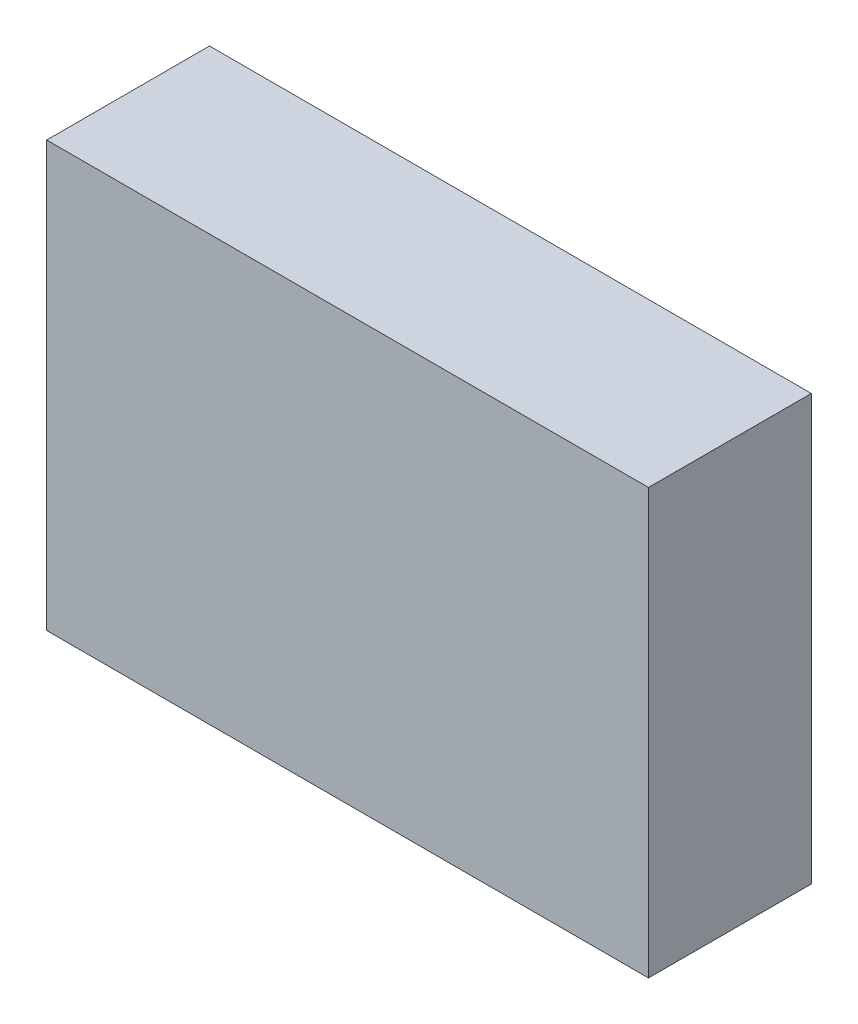
ISO-10303-21;
HEADER;
FILE_DESCRIPTION(('STEP AP214'),'2;1');
FILE_NAME('part.step','',(''),(''),'','','');
FILE_SCHEMA(('AUTOMOTIVE_DESIGN { 1 0 10303 214 1 1 1 1 }'));
ENDSEC;
DATA;
#1=APPLICATION_CONTEXT('core data for automotive mechanical design processes');
#2=APPLICATION_PROTOCOL_DEFINITION('international standard','automotive_design',2000,#1);
#3=PRODUCT_CONTEXT('',#1,'mechanical');
#4=PRODUCT('Part','Part','',(#3));
#5=PRODUCT_RELATED_PRODUCT_CATEGORY('part','',(#4));
#6=PRODUCT_DEFINITION_FORMATION('','',#4);
#7=PRODUCT_DEFINITION_CONTEXT('part definition',#1,'design');
#8=PRODUCT_DEFINITION('design','',#6,#7);
#9=PRODUCT_DEFINITION_SHAPE('','',#8);
#10=(LENGTH_UNIT() NAMED_UNIT(*) SI_UNIT(.MILLI.,.METRE.));
#11=(NAMED_UNIT(*) PLANE_ANGLE_UNIT() SI_UNIT($,.RADIAN.));
#12=(NAMED_UNIT(*) SI_UNIT($,.STERADIAN.) SOLID_ANGLE_UNIT());
#13=UNCERTAINTY_MEASURE_WITH_UNIT(LENGTH_MEASURE(1.E-05),#10,'distance_accuracy_value','');
#14=(GEOMETRIC_REPRESENTATION_CONTEXT(3) GLOBAL_UNCERTAINTY_ASSIGNED_CONTEXT((#13)) GLOBAL_UNIT_ASSIGNED_CONTEXT((#10,
#11,#12)) REPRESENTATION_CONTEXT('',''));
#15=CARTESIAN_POINT('',(0.,0.,0.));
#16=DIRECTION('',(0.,0.,1.));
#17=DIRECTION('',(1.,0.,0.));
#18=AXIS2_PLACEMENT_3D('',#15,#16,#17);
#19=CARTESIAN_POINT('',(15.999587155177,15.3126483669053,2.3));
#20=DIRECTION('',(1.,0.,0.));
#21=DIRECTION('',(0.,1.,0.));
#22=AXIS2_PLACEMENT_3D('',#19,#20,#21);
#23=PLANE('',#22);
#24=DIRECTION('',(0.,-1.,0.));
#25=VECTOR('',#24,1.);
#26=CARTESIAN_POINT('',(15.999587155177,15.3126483669053,0.));
#27=LINE('',#26,#25);
#28=CARTESIAN_POINT('',(15.999587155177,15.3126483669053,0.));
#29=VERTEX_POINT('',#28);
#30=CARTESIAN_POINT('',(15.999587155177,9.31264836690532,0.));
#31=VERTEX_POINT('',#30);
#32=EDGE_CURVE('E100',#29,#31,#27,.T.);
#33=ORIENTED_EDGE('',*,*,#32,.T.);
#34=DIRECTION('',(0.,0.,-1.));
#35=VECTOR('',#34,1.);
#36=CARTESIAN_POINT('',(15.999587155177,9.31264836690532,2.3));
#37=LINE('',#36,#35);
#38=CARTESIAN_POINT('',(15.999587155177,9.31264836690532,2.3));
#39=VERTEX_POINT('',#38);
#40=EDGE_CURVE('E11',#39,#31,#37,.T.);
#41=ORIENTED_EDGE('',*,*,#40,.F.);
#42=DIRECTION('',(0.,-1.,0.));
#43=VECTOR('',#42,1.);
#44=CARTESIAN_POINT('',(15.999587155177,15.3126483669053,2.3));
#45=LINE('',#44,#43);
#46=CARTESIAN_POINT('',(15.999587155177,15.3126483669053,2.3));
#47=VERTEX_POINT('',#46);
#48=EDGE_CURVE('E88',#47,#39,#45,.T.);
#49=ORIENTED_EDGE('',*,*,#48,.F.);
#50=DIRECTION('',(0.,0.,-1.));
#51=VECTOR('',#50,1.);
#52=CARTESIAN_POINT('',(15.999587155177,15.3126483669053,2.3));
#53=LINE('',#52,#51);
#54=EDGE_CURVE('E96',#47,#29,#53,.T.);
#55=ORIENTED_EDGE('',*,*,#54,.T.);
#56=EDGE_LOOP('',(#33,#41,#49,#55));
#57=FACE_BOUND('',#56,.T.);
#58=ADVANCED_FACE('F37',(#57),#23,.F.);
#59=CARTESIAN_POINT('',(15.999587155177,9.31264836690532,2.3));
#60=DIRECTION('',(0.,1.,0.));
#61=DIRECTION('',(-1.,0.,0.));
#62=AXIS2_PLACEMENT_3D('',#59,#60,#61);
#63=PLANE('',#62);
#64=DIRECTION('',(1.,0.,0.));
#65=VECTOR('',#64,1.);
#66=CARTESIAN_POINT('',(15.999587155177,9.31264836690532,0.));
#67=LINE('',#66,#65);
#68=CARTESIAN_POINT('',(24.499587155177,9.31264836690532,0.));
#69=VERTEX_POINT('',#68);
#70=EDGE_CURVE('E92',#31,#69,#67,.T.);
#71=ORIENTED_EDGE('',*,*,#70,.T.);
#72=DIRECTION('',(0.,0.,-1.));
#73=VECTOR('',#72,1.);
#74=CARTESIAN_POINT('',(24.499587155177,9.31264836690532,2.3));
#75=LINE('',#74,#73);
#76=CARTESIAN_POINT('',(24.499587155177,9.31264836690532,2.3));
#77=VERTEX_POINT('',#76);
#78=EDGE_CURVE('E45',#77,#69,#75,.T.);
#79=ORIENTED_EDGE('',*,*,#78,.F.);
#80=DIRECTION('',(1.,0.,0.));
#81=VECTOR('',#80,1.);
#82=CARTESIAN_POINT('',(15.999587155177,9.31264836690532,2.3));
#83=LINE('',#82,#81);
#84=EDGE_CURVE('E83',#39,#77,#83,.T.);
#85=ORIENTED_EDGE('',*,*,#84,.F.);
#86=ORIENTED_EDGE('',*,*,#40,.T.);
#87=EDGE_LOOP('',(#71,#79,#85,#86));
#88=FACE_BOUND('',#87,.T.);
#89=ADVANCED_FACE('F91',(#88),#63,.F.);
#90=CARTESIAN_POINT('',(24.499587155177,15.3126483669053,2.3));
#91=DIRECTION('',(-1.,0.,0.));
#92=DIRECTION('',(0.,0.,1.));
#93=AXIS2_PLACEMENT_3D('',#90,#91,#92);
#94=PLANE('',#93);
#95=DIRECTION('',(0.,1.,0.));
#96=VECTOR('',#95,1.);
#97=CARTESIAN_POINT('',(24.499587155177,15.3126483669053,0.));
#98=LINE('',#97,#96);
#99=CARTESIAN_POINT('',(24.499587155177,15.3126483669053,0.));
#100=VERTEX_POINT('',#99);
#101=EDGE_CURVE('E70',#69,#100,#98,.T.);
#102=ORIENTED_EDGE('',*,*,#101,.T.);
#103=DIRECTION('',(0.,0.,-1.));
#104=VECTOR('',#103,1.);
#105=CARTESIAN_POINT('',(24.499587155177,15.3126483669053,2.3));
#106=LINE('',#105,#104);
#107=CARTESIAN_POINT('',(24.499587155177,15.3126483669053,2.3));
#108=VERTEX_POINT('',#107);
#109=EDGE_CURVE('E93',#108,#100,#106,.T.);
#110=ORIENTED_EDGE('',*,*,#109,.F.);
#111=DIRECTION('',(0.,1.,0.));
#112=VECTOR('',#111,1.);
#113=CARTESIAN_POINT('',(24.499587155177,15.3126483669053,2.3));
#114=LINE('',#113,#112);
#115=EDGE_CURVE('E86',#77,#108,#114,.T.);
#116=ORIENTED_EDGE('',*,*,#115,.F.);
#117=ORIENTED_EDGE('',*,*,#78,.T.);
#118=EDGE_LOOP('',(#102,#110,#116,#117));
#119=FACE_BOUND('',#118,.T.);
#120=ADVANCED_FACE('F94',(#119),#94,.F.);
#121=CARTESIAN_POINT('',(15.999587155177,15.3126483669053,2.3));
#122=DIRECTION('',(0.,-1.,0.));
#123=DIRECTION('',(1.,0.,0.));
#124=AXIS2_PLACEMENT_3D('',#121,#122,#123);
#125=PLANE('',#124);
#126=DIRECTION('',(-1.,0.,0.));
#127=VECTOR('',#126,1.);
#128=CARTESIAN_POINT('',(15.999587155177,15.3126483669053,0.));
#129=LINE('',#128,#127);
#130=EDGE_CURVE('E76',#100,#29,#129,.T.);
#131=ORIENTED_EDGE('',*,*,#130,.T.);
#132=ORIENTED_EDGE('',*,*,#54,.F.);
#133=DIRECTION('',(-1.,0.,0.));
#134=VECTOR('',#133,1.);
#135=CARTESIAN_POINT('',(15.999587155177,15.3126483669053,2.3));
#136=LINE('',#135,#134);
#137=EDGE_CURVE('E53',#108,#47,#136,.T.);
#138=ORIENTED_EDGE('',*,*,#137,.F.);
#139=ORIENTED_EDGE('',*,*,#109,.T.);
#140=EDGE_LOOP('',(#131,#132,#138,#139));
#141=FACE_BOUND('',#140,.T.);
#142=ADVANCED_FACE('F107',(#141),#125,.F.);
#143=CARTESIAN_POINT('',(0.,0.,2.3));
#144=DIRECTION('',(0.,0.,1.));
#145=DIRECTION('',(1.,0.,0.));
#146=AXIS2_PLACEMENT_3D('',#143,#144,#145);
#147=PLANE('',#146);
#148=ORIENTED_EDGE('',*,*,#48,.T.);
#149=ORIENTED_EDGE('',*,*,#84,.T.);
#150=ORIENTED_EDGE('',*,*,#115,.T.);
#151=ORIENTED_EDGE('',*,*,#137,.T.);
#152=EDGE_LOOP('',(#148,#149,#150,#151));
#153=FACE_BOUND('',#152,.T.);
#154=ADVANCED_FACE('F84',(#153),#147,.T.);
#155=CARTESIAN_POINT('',(0.,0.,0.));
#156=DIRECTION('',(0.,0.,1.));
#157=DIRECTION('',(1.,0.,0.));
#158=AXIS2_PLACEMENT_3D('',#155,#156,#157);
#159=PLANE('',#158);
#160=ORIENTED_EDGE('',*,*,#32,.F.);
#161=ORIENTED_EDGE('',*,*,#130,.F.);
#162=ORIENTED_EDGE('',*,*,#101,.F.);
#163=ORIENTED_EDGE('',*,*,#70,.F.);
#164=EDGE_LOOP('',(#160,#161,#162,#163));
#165=FACE_BOUND('',#164,.T.);
#166=ADVANCED_FACE('F110',(#165),#159,.F.);
#167=CLOSED_SHELL('',(#58,#89,#120,#142,#154,#166));
#168=MANIFOLD_SOLID_BREP('B2',#167);
#169=ADVANCED_BREP_SHAPE_REPRESENTATION('',(#18,#168),#14);
#170=SHAPE_DEFINITION_REPRESENTATION(#9,#169);
ENDSEC;
END-ISO-10303-21;
